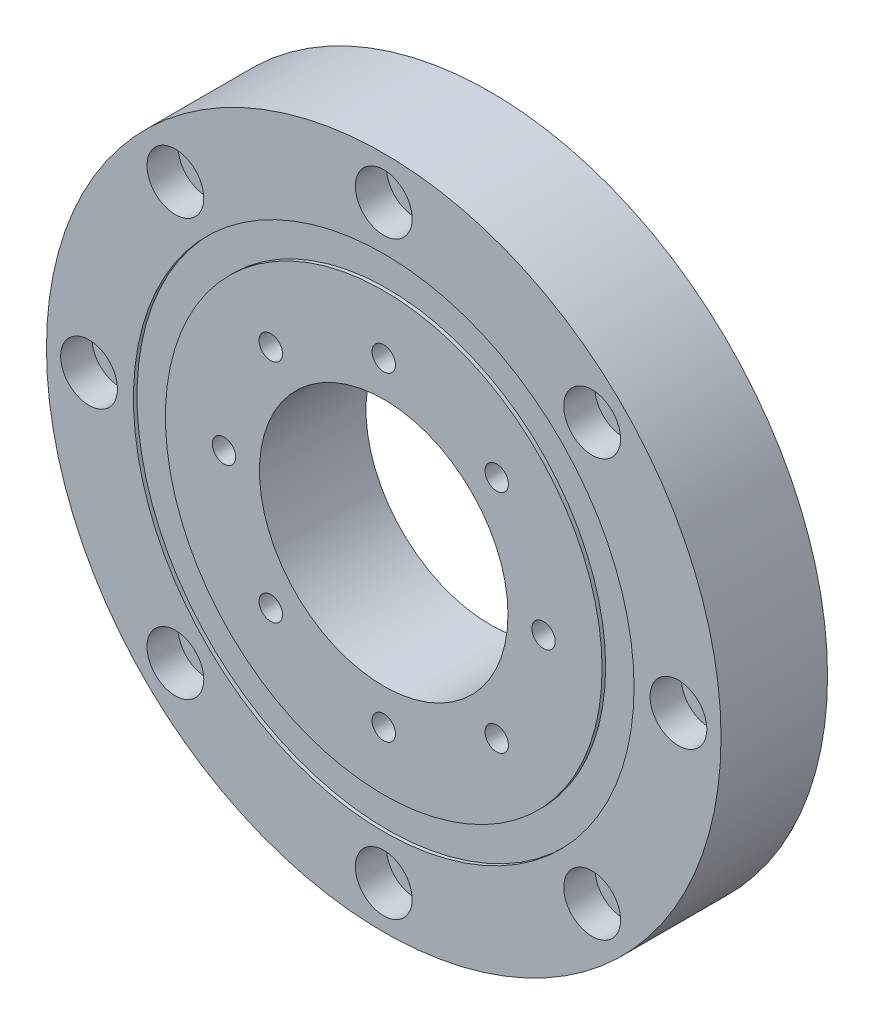
ISO-10303-21;
HEADER;
FILE_DESCRIPTION(('STEP AP214'),'2;1');
FILE_NAME('part.step','',(''),(''),'','','');
FILE_SCHEMA(('AUTOMOTIVE_DESIGN { 1 0 10303 214 1 1 1 1 }'));
ENDSEC;
DATA;
#1=APPLICATION_CONTEXT('core data for automotive mechanical design processes');
#2=APPLICATION_PROTOCOL_DEFINITION('international standard','automotive_design',2000,#1);
#3=PRODUCT_CONTEXT('',#1,'mechanical');
#4=PRODUCT('Part','Part','',(#3));
#5=PRODUCT_RELATED_PRODUCT_CATEGORY('part','',(#4));
#6=PRODUCT_DEFINITION_FORMATION('','',#4);
#7=PRODUCT_DEFINITION_CONTEXT('part definition',#1,'design');
#8=PRODUCT_DEFINITION('design','',#6,#7);
#9=PRODUCT_DEFINITION_SHAPE('','',#8);
#10=(LENGTH_UNIT() NAMED_UNIT(*) SI_UNIT(.MILLI.,.METRE.));
#11=(NAMED_UNIT(*) PLANE_ANGLE_UNIT() SI_UNIT($,.RADIAN.));
#12=(NAMED_UNIT(*) SI_UNIT($,.STERADIAN.) SOLID_ANGLE_UNIT());
#13=UNCERTAINTY_MEASURE_WITH_UNIT(LENGTH_MEASURE(1.E-05),#10,'distance_accuracy_value','');
#14=(GEOMETRIC_REPRESENTATION_CONTEXT(3) GLOBAL_UNCERTAINTY_ASSIGNED_CONTEXT((#13)) GLOBAL_UNIT_ASSIGNED_CONTEXT((#10,
#11,#12)) REPRESENTATION_CONTEXT('',''));
#15=CARTESIAN_POINT('',(0.,0.,0.));
#16=DIRECTION('',(0.,0.,1.));
#17=DIRECTION('',(1.,0.,0.));
#18=AXIS2_PLACEMENT_3D('',#15,#16,#17);
#19=CARTESIAN_POINT('',(0.,0.,-7.5));
#20=DIRECTION('',(0.,0.,1.));
#21=DIRECTION('',(1.,0.,0.));
#22=AXIS2_PLACEMENT_3D('',#19,#20,#21);
#23=PLANE('',#22);
#24=CARTESIAN_POINT('',(15.9099025766971,15.9099025766975,-7.5));
#25=DIRECTION('',(0.,0.,1.));
#26=DIRECTION('',(1.,0.,0.));
#27=AXIS2_PLACEMENT_3D('',#24,#25,#26);
#28=CIRCLE('',#27,1.65);
#29=CARTESIAN_POINT('',(17.5599025766971,15.9099025766975,-7.5));
#30=VERTEX_POINT('',#29);
#31=EDGE_CURVE('E212',#30,#30,#28,.T.);
#32=ORIENTED_EDGE('',*,*,#31,.T.);
#33=EDGE_LOOP('',(#32));
#34=FACE_BOUND('',#33,.T.);
#35=CARTESIAN_POINT('',(22.5,2.35674990371912E-13,-7.5));
#36=DIRECTION('',(0.,0.,1.));
#37=DIRECTION('',(1.,0.,0.));
#38=AXIS2_PLACEMENT_3D('',#35,#36,#37);
#39=CIRCLE('',#38,1.65);
#40=CARTESIAN_POINT('',(24.15,2.35674990371912E-13,-7.5));
#41=VERTEX_POINT('',#40);
#42=EDGE_CURVE('E206',#41,#41,#39,.T.);
#43=ORIENTED_EDGE('',*,*,#42,.T.);
#44=EDGE_LOOP('',(#43));
#45=FACE_BOUND('',#44,.T.);
#46=CARTESIAN_POINT('',(15.9099025766975,-15.9099025766972,-7.5));
#47=DIRECTION('',(0.,0.,1.));
#48=DIRECTION('',(1.,0.,0.));
#49=AXIS2_PLACEMENT_3D('',#46,#47,#48);
#50=CIRCLE('',#49,1.65);
#51=CARTESIAN_POINT('',(17.5599025766975,-15.9099025766972,-7.5));
#52=VERTEX_POINT('',#51);
#53=EDGE_CURVE('E200',#52,#52,#50,.T.);
#54=ORIENTED_EDGE('',*,*,#53,.T.);
#55=EDGE_LOOP('',(#54));
#56=FACE_BOUND('',#55,.T.);
#57=CARTESIAN_POINT('',(0.,-22.5,-7.5));
#58=DIRECTION('',(0.,0.,1.));
#59=DIRECTION('',(1.,0.,0.));
#60=AXIS2_PLACEMENT_3D('',#57,#58,#59);
#61=CIRCLE('',#60,1.65);
#62=CARTESIAN_POINT('',(1.65,-22.5,-7.5));
#63=VERTEX_POINT('',#62);
#64=EDGE_CURVE('E194',#63,#63,#61,.T.);
#65=ORIENTED_EDGE('',*,*,#64,.T.);
#66=EDGE_LOOP('',(#65));
#67=FACE_BOUND('',#66,.T.);
#68=CARTESIAN_POINT('',(-15.9099025766972,-15.9099025766974,-7.5));
#69=DIRECTION('',(0.,0.,1.));
#70=DIRECTION('',(1.,0.,0.));
#71=AXIS2_PLACEMENT_3D('',#68,#69,#70);
#72=CIRCLE('',#71,1.65);
#73=CARTESIAN_POINT('',(-14.2599025766972,-15.9099025766974,-7.5));
#74=VERTEX_POINT('',#73);
#75=EDGE_CURVE('E188',#74,#74,#72,.T.);
#76=ORIENTED_EDGE('',*,*,#75,.T.);
#77=EDGE_LOOP('',(#76));
#78=FACE_BOUND('',#77,.T.);
#79=CARTESIAN_POINT('',(-22.5,0.,-7.5));
#80=DIRECTION('',(0.,0.,1.));
#81=DIRECTION('',(1.,0.,0.));
#82=AXIS2_PLACEMENT_3D('',#79,#80,#81);
#83=CIRCLE('',#82,1.65);
#84=CARTESIAN_POINT('',(-20.85,0.,-7.5));
#85=VERTEX_POINT('',#84);
#86=EDGE_CURVE('E182',#85,#85,#83,.T.);
#87=ORIENTED_EDGE('',*,*,#86,.T.);
#88=EDGE_LOOP('',(#87));
#89=FACE_BOUND('',#88,.T.);
#90=CARTESIAN_POINT('',(-15.9099025766973,15.9099025766973,-7.5));
#91=DIRECTION('',(0.,0.,1.));
#92=DIRECTION('',(1.,0.,0.));
#93=AXIS2_PLACEMENT_3D('',#90,#91,#92);
#94=CIRCLE('',#93,1.65);
#95=CARTESIAN_POINT('',(-14.2599025766973,15.9099025766973,-7.5));
#96=VERTEX_POINT('',#95);
#97=EDGE_CURVE('E176',#96,#96,#94,.T.);
#98=ORIENTED_EDGE('',*,*,#97,.T.);
#99=EDGE_LOOP('',(#98));
#100=FACE_BOUND('',#99,.T.);
#101=CARTESIAN_POINT('',(0.,22.5,-7.5));
#102=DIRECTION('',(0.,0.,1.));
#103=DIRECTION('',(1.,0.,0.));
#104=AXIS2_PLACEMENT_3D('',#101,#102,#103);
#105=CIRCLE('',#104,1.65);
#106=CARTESIAN_POINT('',(1.65,22.5,-7.5));
#107=VERTEX_POINT('',#106);
#108=EDGE_CURVE('E86',#107,#107,#105,.T.);
#109=ORIENTED_EDGE('',*,*,#108,.T.);
#110=EDGE_LOOP('',(#109));
#111=FACE_BOUND('',#110,.T.);
#112=CARTESIAN_POINT('',(0.,0.,-7.5));
#113=DIRECTION('',(0.,0.,1.));
#114=DIRECTION('',(1.,0.,0.));
#115=AXIS2_PLACEMENT_3D('',#112,#113,#114);
#116=CIRCLE('',#115,17.5);
#117=CARTESIAN_POINT('',(17.5,0.,-7.5));
#118=VERTEX_POINT('',#117);
#119=EDGE_CURVE('E43',#118,#118,#116,.T.);
#120=ORIENTED_EDGE('',*,*,#119,.T.);
#121=EDGE_LOOP('',(#120));
#122=FACE_BOUND('',#121,.T.);
#123=CARTESIAN_POINT('',(0.,0.,-7.5));
#124=DIRECTION('',(0.,0.,1.));
#125=DIRECTION('',(1.,0.,0.));
#126=AXIS2_PLACEMENT_3D('',#123,#124,#125);
#127=CIRCLE('',#126,30.75);
#128=CARTESIAN_POINT('',(30.75,0.,-7.5));
#129=VERTEX_POINT('',#128);
#130=EDGE_CURVE('E69',#129,#129,#127,.T.);
#131=ORIENTED_EDGE('',*,*,#130,.F.);
#132=EDGE_LOOP('',(#131));
#133=FACE_BOUND('',#132,.T.);
#134=ADVANCED_FACE('F32',(#34,#45,#56,#67,#78,#89,#100,#111,#122,#133),#23,.F.);
#135=CARTESIAN_POINT('',(0.,0.,7.5));
#136=DIRECTION('',(0.,0.,1.));
#137=DIRECTION('',(1.,0.,0.));
#138=AXIS2_PLACEMENT_3D('',#135,#136,#137);
#139=PLANE('',#138);
#140=CARTESIAN_POINT('',(15.9099025766971,15.9099025766975,7.5));
#141=DIRECTION('',(0.,0.,1.));
#142=DIRECTION('',(1.,0.,0.));
#143=AXIS2_PLACEMENT_3D('',#140,#141,#142);
#144=CIRCLE('',#143,1.65);
#145=CARTESIAN_POINT('',(17.5599025766971,15.9099025766975,7.5));
#146=VERTEX_POINT('',#145);
#147=EDGE_CURVE('E215',#146,#146,#144,.T.);
#148=ORIENTED_EDGE('',*,*,#147,.F.);
#149=EDGE_LOOP('',(#148));
#150=FACE_BOUND('',#149,.T.);
#151=CARTESIAN_POINT('',(22.5,2.35674990371912E-13,7.5));
#152=DIRECTION('',(0.,0.,1.));
#153=DIRECTION('',(1.,0.,0.));
#154=AXIS2_PLACEMENT_3D('',#151,#152,#153);
#155=CIRCLE('',#154,1.65);
#156=CARTESIAN_POINT('',(24.15,2.35674990371912E-13,7.5));
#157=VERTEX_POINT('',#156);
#158=EDGE_CURVE('E209',#157,#157,#155,.T.);
#159=ORIENTED_EDGE('',*,*,#158,.F.);
#160=EDGE_LOOP('',(#159));
#161=FACE_BOUND('',#160,.T.);
#162=CARTESIAN_POINT('',(15.9099025766975,-15.9099025766972,7.5));
#163=DIRECTION('',(0.,0.,1.));
#164=DIRECTION('',(1.,0.,0.));
#165=AXIS2_PLACEMENT_3D('',#162,#163,#164);
#166=CIRCLE('',#165,1.65);
#167=CARTESIAN_POINT('',(17.5599025766975,-15.9099025766972,7.5));
#168=VERTEX_POINT('',#167);
#169=EDGE_CURVE('E203',#168,#168,#166,.T.);
#170=ORIENTED_EDGE('',*,*,#169,.F.);
#171=EDGE_LOOP('',(#170));
#172=FACE_BOUND('',#171,.T.);
#173=CARTESIAN_POINT('',(0.,-22.5,7.5));
#174=DIRECTION('',(0.,0.,1.));
#175=DIRECTION('',(1.,0.,0.));
#176=AXIS2_PLACEMENT_3D('',#173,#174,#175);
#177=CIRCLE('',#176,1.65);
#178=CARTESIAN_POINT('',(1.65,-22.5,7.5));
#179=VERTEX_POINT('',#178);
#180=EDGE_CURVE('E197',#179,#179,#177,.T.);
#181=ORIENTED_EDGE('',*,*,#180,.F.);
#182=EDGE_LOOP('',(#181));
#183=FACE_BOUND('',#182,.T.);
#184=CARTESIAN_POINT('',(-15.9099025766972,-15.9099025766974,7.5));
#185=DIRECTION('',(0.,0.,1.));
#186=DIRECTION('',(1.,0.,0.));
#187=AXIS2_PLACEMENT_3D('',#184,#185,#186);
#188=CIRCLE('',#187,1.65);
#189=CARTESIAN_POINT('',(-14.2599025766972,-15.9099025766974,7.5));
#190=VERTEX_POINT('',#189);
#191=EDGE_CURVE('E191',#190,#190,#188,.T.);
#192=ORIENTED_EDGE('',*,*,#191,.F.);
#193=EDGE_LOOP('',(#192));
#194=FACE_BOUND('',#193,.T.);
#195=CARTESIAN_POINT('',(-22.5,0.,7.5));
#196=DIRECTION('',(0.,0.,1.));
#197=DIRECTION('',(1.,0.,0.));
#198=AXIS2_PLACEMENT_3D('',#195,#196,#197);
#199=CIRCLE('',#198,1.65);
#200=CARTESIAN_POINT('',(-20.85,0.,7.5));
#201=VERTEX_POINT('',#200);
#202=EDGE_CURVE('E185',#201,#201,#199,.T.);
#203=ORIENTED_EDGE('',*,*,#202,.F.);
#204=EDGE_LOOP('',(#203));
#205=FACE_BOUND('',#204,.T.);
#206=CARTESIAN_POINT('',(-15.9099025766973,15.9099025766973,7.5));
#207=DIRECTION('',(0.,0.,1.));
#208=DIRECTION('',(1.,0.,0.));
#209=AXIS2_PLACEMENT_3D('',#206,#207,#208);
#210=CIRCLE('',#209,1.65);
#211=CARTESIAN_POINT('',(-14.2599025766973,15.9099025766973,7.5));
#212=VERTEX_POINT('',#211);
#213=EDGE_CURVE('E179',#212,#212,#210,.T.);
#214=ORIENTED_EDGE('',*,*,#213,.F.);
#215=EDGE_LOOP('',(#214));
#216=FACE_BOUND('',#215,.T.);
#217=CARTESIAN_POINT('',(0.,22.5,7.5));
#218=DIRECTION('',(0.,0.,1.));
#219=DIRECTION('',(1.,0.,0.));
#220=AXIS2_PLACEMENT_3D('',#217,#218,#219);
#221=CIRCLE('',#220,1.65);
#222=CARTESIAN_POINT('',(1.65,22.5,7.5));
#223=VERTEX_POINT('',#222);
#224=EDGE_CURVE('E89',#223,#223,#221,.T.);
#225=ORIENTED_EDGE('',*,*,#224,.F.);
#226=EDGE_LOOP('',(#225));
#227=FACE_BOUND('',#226,.T.);
#228=CARTESIAN_POINT('',(0.,0.,7.5));
#229=DIRECTION('',(0.,0.,1.));
#230=DIRECTION('',(1.,0.,0.));
#231=AXIS2_PLACEMENT_3D('',#228,#229,#230);
#232=CIRCLE('',#231,17.5);
#233=CARTESIAN_POINT('',(17.5,0.,7.5));
#234=VERTEX_POINT('',#233);
#235=EDGE_CURVE('E45',#234,#234,#232,.T.);
#236=ORIENTED_EDGE('',*,*,#235,.F.);
#237=EDGE_LOOP('',(#236));
#238=FACE_BOUND('',#237,.T.);
#239=CARTESIAN_POINT('',(0.,0.,7.5));
#240=DIRECTION('',(0.,0.,1.));
#241=DIRECTION('',(1.,0.,0.));
#242=AXIS2_PLACEMENT_3D('',#239,#240,#241);
#243=CIRCLE('',#242,30.75);
#244=CARTESIAN_POINT('',(30.75,0.,7.5));
#245=VERTEX_POINT('',#244);
#246=EDGE_CURVE('E57',#245,#245,#243,.T.);
#247=ORIENTED_EDGE('',*,*,#246,.T.);
#248=EDGE_LOOP('',(#247));
#249=FACE_BOUND('',#248,.T.);
#250=ADVANCED_FACE('F221',(#150,#161,#172,#183,#194,#205,#216,#227,#238,#249),#139,.T.);
#251=CARTESIAN_POINT('',(0.,0.,7.5));
#252=DIRECTION('',(0.,0.,-1.));
#253=DIRECTION('',(-1.,0.,0.));
#254=AXIS2_PLACEMENT_3D('',#251,#252,#253);
#255=CYLINDRICAL_SURFACE('',#254,47.5);
#256=CARTESIAN_POINT('',(0.,0.,7.5));
#257=DIRECTION('',(0.,0.,1.));
#258=DIRECTION('',(1.,0.,0.));
#259=AXIS2_PLACEMENT_3D('',#256,#257,#258);
#260=CIRCLE('',#259,47.5);
#261=CARTESIAN_POINT('',(47.5,0.,7.5));
#262=VERTEX_POINT('',#261);
#263=EDGE_CURVE('E10',#262,#262,#260,.T.);
#264=ORIENTED_EDGE('',*,*,#263,.F.);
#265=EDGE_LOOP('',(#264));
#266=FACE_BOUND('',#265,.T.);
#267=CARTESIAN_POINT('',(0.,0.,-7.5));
#268=DIRECTION('',(0.,0.,1.));
#269=DIRECTION('',(1.,0.,0.));
#270=AXIS2_PLACEMENT_3D('',#267,#268,#269);
#271=CIRCLE('',#270,47.5);
#272=CARTESIAN_POINT('',(47.5,0.,-7.5));
#273=VERTEX_POINT('',#272);
#274=EDGE_CURVE('E36',#273,#273,#271,.T.);
#275=ORIENTED_EDGE('',*,*,#274,.T.);
#276=EDGE_LOOP('',(#275));
#277=FACE_BOUND('',#276,.T.);
#278=ADVANCED_FACE('F34',(#266,#277),#255,.T.);
#279=CARTESIAN_POINT('',(29.3449314192414,29.3449314192421,7.5));
#280=DIRECTION('',(0.,0.,1.));
#281=DIRECTION('',(1.,0.,0.));
#282=AXIS2_PLACEMENT_3D('',#279,#280,#281);
#283=CIRCLE('',#282,4.);
#284=CARTESIAN_POINT('',(33.3449314192414,29.3449314192421,7.5));
#285=VERTEX_POINT('',#284);
#286=EDGE_CURVE('E173',#285,#285,#283,.T.);
#287=ORIENTED_EDGE('',*,*,#286,.F.);
#288=EDGE_LOOP('',(#287));
#289=FACE_BOUND('',#288,.T.);
#290=CARTESIAN_POINT('',(41.5,4.23177746773985E-13,7.5));
#291=DIRECTION('',(0.,0.,1.));
#292=DIRECTION('',(1.,0.,0.));
#293=AXIS2_PLACEMENT_3D('',#290,#291,#292);
#294=CIRCLE('',#293,4.);
#295=CARTESIAN_POINT('',(45.5,4.23177746773985E-13,7.5));
#296=VERTEX_POINT('',#295);
#297=EDGE_CURVE('E161',#296,#296,#294,.T.);
#298=ORIENTED_EDGE('',*,*,#297,.F.);
#299=EDGE_LOOP('',(#298));
#300=FACE_BOUND('',#299,.T.);
#301=CARTESIAN_POINT('',(29.344931419242,-29.3449314192415,7.5));
#302=DIRECTION('',(0.,0.,1.));
#303=DIRECTION('',(1.,0.,0.));
#304=AXIS2_PLACEMENT_3D('',#301,#302,#303);
#305=CIRCLE('',#304,4.);
#306=CARTESIAN_POINT('',(33.344931419242,-29.3449314192415,7.5));
#307=VERTEX_POINT('',#306);
#308=EDGE_CURVE('E149',#307,#307,#305,.T.);
#309=ORIENTED_EDGE('',*,*,#308,.F.);
#310=EDGE_LOOP('',(#309));
#311=FACE_BOUND('',#310,.T.);
#312=CARTESIAN_POINT('',(0.,-41.5,7.5));
#313=DIRECTION('',(0.,0.,1.));
#314=DIRECTION('',(1.,0.,0.));
#315=AXIS2_PLACEMENT_3D('',#312,#313,#314);
#316=CIRCLE('',#315,4.);
#317=CARTESIAN_POINT('',(3.99999999999999,-41.5,7.5));
#318=VERTEX_POINT('',#317);
#319=EDGE_CURVE('E137',#318,#318,#316,.T.);
#320=ORIENTED_EDGE('',*,*,#319,.F.);
#321=EDGE_LOOP('',(#320));
#322=FACE_BOUND('',#321,.T.);
#323=CARTESIAN_POINT('',(-29.3449314192416,-29.3449314192419,7.5));
#324=DIRECTION('',(0.,0.,1.));
#325=DIRECTION('',(1.,0.,0.));
#326=AXIS2_PLACEMENT_3D('',#323,#324,#325);
#327=CIRCLE('',#326,4.);
#328=CARTESIAN_POINT('',(-25.3449314192416,-29.3449314192419,7.5));
#329=VERTEX_POINT('',#328);
#330=EDGE_CURVE('E125',#329,#329,#327,.T.);
#331=ORIENTED_EDGE('',*,*,#330,.F.);
#332=EDGE_LOOP('',(#331));
#333=FACE_BOUND('',#332,.T.);
#334=CARTESIAN_POINT('',(-41.5,-1.33384795650005E-13,7.5));
#335=DIRECTION('',(0.,0.,1.));
#336=DIRECTION('',(1.,0.,0.));
#337=AXIS2_PLACEMENT_3D('',#334,#335,#336);
#338=CIRCLE('',#337,4.);
#339=CARTESIAN_POINT('',(-37.5,-1.33384795650005E-13,7.5));
#340=VERTEX_POINT('',#339);
#341=EDGE_CURVE('E113',#340,#340,#338,.T.);
#342=ORIENTED_EDGE('',*,*,#341,.F.);
#343=EDGE_LOOP('',(#342));
#344=FACE_BOUND('',#343,.T.);
#345=CARTESIAN_POINT('',(-29.3449314192418,29.3449314192417,7.5));
#346=DIRECTION('',(0.,0.,1.));
#347=DIRECTION('',(1.,0.,0.));
#348=AXIS2_PLACEMENT_3D('',#345,#346,#347);
#349=CIRCLE('',#348,4.);
#350=CARTESIAN_POINT('',(-25.3449314192418,29.3449314192417,7.5));
#351=VERTEX_POINT('',#350);
#352=EDGE_CURVE('E101',#351,#351,#349,.T.);
#353=ORIENTED_EDGE('',*,*,#352,.F.);
#354=EDGE_LOOP('',(#353));
#355=FACE_BOUND('',#354,.T.);
#356=CARTESIAN_POINT('',(0.,41.5,7.5));
#357=DIRECTION('',(0.,0.,1.));
#358=DIRECTION('',(1.,0.,0.));
#359=AXIS2_PLACEMENT_3D('',#356,#357,#358);
#360=CIRCLE('',#359,4.);
#361=CARTESIAN_POINT('',(4.00000000000001,41.5,7.5));
#362=VERTEX_POINT('',#361);
#363=EDGE_CURVE('E83',#362,#362,#360,.T.);
#364=ORIENTED_EDGE('',*,*,#363,.F.);
#365=EDGE_LOOP('',(#364));
#366=FACE_BOUND('',#365,.T.);
#367=CARTESIAN_POINT('',(0.,0.,7.5));
#368=DIRECTION('',(0.,0.,1.));
#369=DIRECTION('',(1.,0.,0.));
#370=AXIS2_PLACEMENT_3D('',#367,#368,#369);
#371=CIRCLE('',#370,35.25);
#372=CARTESIAN_POINT('',(35.25,0.,7.5));
#373=VERTEX_POINT('',#372);
#374=EDGE_CURVE('E51',#373,#373,#371,.T.);
#375=ORIENTED_EDGE('',*,*,#374,.F.);
#376=EDGE_LOOP('',(#375));
#377=FACE_BOUND('',#376,.T.);
#378=ORIENTED_EDGE('',*,*,#263,.T.);
#379=EDGE_LOOP('',(#378));
#380=FACE_BOUND('',#379,.T.);
#381=ADVANCED_FACE('F225',(#289,#300,#311,#322,#333,#344,#355,#366,#377,#380),#139,.T.);
#382=CARTESIAN_POINT('',(29.3449314192414,29.3449314192421,-7.5));
#383=DIRECTION('',(0.,0.,1.));
#384=DIRECTION('',(1.,0.,0.));
#385=AXIS2_PLACEMENT_3D('',#382,#383,#384);
#386=CIRCLE('',#385,2.25);
#387=CARTESIAN_POINT('',(31.5949314192414,29.3449314192421,-7.5));
#388=VERTEX_POINT('',#387);
#389=EDGE_CURVE('E164',#388,#388,#386,.T.);
#390=ORIENTED_EDGE('',*,*,#389,.T.);
#391=EDGE_LOOP('',(#390));
#392=FACE_BOUND('',#391,.T.);
#393=CARTESIAN_POINT('',(41.5,4.23177746773985E-13,-7.5));
#394=DIRECTION('',(0.,0.,1.));
#395=DIRECTION('',(1.,0.,0.));
#396=AXIS2_PLACEMENT_3D('',#393,#394,#395);
#397=CIRCLE('',#396,2.25);
#398=CARTESIAN_POINT('',(43.75,4.23177746773985E-13,-7.5));
#399=VERTEX_POINT('',#398);
#400=EDGE_CURVE('E152',#399,#399,#397,.T.);
#401=ORIENTED_EDGE('',*,*,#400,.T.);
#402=EDGE_LOOP('',(#401));
#403=FACE_BOUND('',#402,.T.);
#404=CARTESIAN_POINT('',(29.344931419242,-29.3449314192415,-7.5));
#405=DIRECTION('',(0.,0.,1.));
#406=DIRECTION('',(1.,0.,0.));
#407=AXIS2_PLACEMENT_3D('',#404,#405,#406);
#408=CIRCLE('',#407,2.25);
#409=CARTESIAN_POINT('',(31.594931419242,-29.3449314192415,-7.5));
#410=VERTEX_POINT('',#409);
#411=EDGE_CURVE('E140',#410,#410,#408,.T.);
#412=ORIENTED_EDGE('',*,*,#411,.T.);
#413=EDGE_LOOP('',(#412));
#414=FACE_BOUND('',#413,.T.);
#415=CARTESIAN_POINT('',(0.,-41.5,-7.5));
#416=DIRECTION('',(0.,0.,1.));
#417=DIRECTION('',(1.,0.,0.));
#418=AXIS2_PLACEMENT_3D('',#415,#416,#417);
#419=CIRCLE('',#418,2.25);
#420=CARTESIAN_POINT('',(2.24999999999998,-41.5,-7.5));
#421=VERTEX_POINT('',#420);
#422=EDGE_CURVE('E128',#421,#421,#419,.T.);
#423=ORIENTED_EDGE('',*,*,#422,.T.);
#424=EDGE_LOOP('',(#423));
#425=FACE_BOUND('',#424,.T.);
#426=CARTESIAN_POINT('',(-29.3449314192416,-29.3449314192419,-7.5));
#427=DIRECTION('',(0.,0.,1.));
#428=DIRECTION('',(1.,0.,0.));
#429=AXIS2_PLACEMENT_3D('',#426,#427,#428);
#430=CIRCLE('',#429,2.25);
#431=CARTESIAN_POINT('',(-27.0949314192416,-29.3449314192419,-7.5));
#432=VERTEX_POINT('',#431);
#433=EDGE_CURVE('E116',#432,#432,#430,.T.);
#434=ORIENTED_EDGE('',*,*,#433,.T.);
#435=EDGE_LOOP('',(#434));
#436=FACE_BOUND('',#435,.T.);
#437=CARTESIAN_POINT('',(-41.5,-1.33384795650005E-13,-7.5));
#438=DIRECTION('',(0.,0.,1.));
#439=DIRECTION('',(1.,0.,0.));
#440=AXIS2_PLACEMENT_3D('',#437,#438,#439);
#441=CIRCLE('',#440,2.25);
#442=CARTESIAN_POINT('',(-39.25,-1.33384795650005E-13,-7.5));
#443=VERTEX_POINT('',#442);
#444=EDGE_CURVE('E104',#443,#443,#441,.T.);
#445=ORIENTED_EDGE('',*,*,#444,.T.);
#446=EDGE_LOOP('',(#445));
#447=FACE_BOUND('',#446,.T.);
#448=CARTESIAN_POINT('',(-29.3449314192418,29.3449314192417,-7.5));
#449=DIRECTION('',(0.,0.,1.));
#450=DIRECTION('',(1.,0.,0.));
#451=AXIS2_PLACEMENT_3D('',#448,#449,#450);
#452=CIRCLE('',#451,2.25);
#453=CARTESIAN_POINT('',(-27.0949314192418,29.3449314192417,-7.5));
#454=VERTEX_POINT('',#453);
#455=EDGE_CURVE('E92',#454,#454,#452,.T.);
#456=ORIENTED_EDGE('',*,*,#455,.T.);
#457=EDGE_LOOP('',(#456));
#458=FACE_BOUND('',#457,.T.);
#459=CARTESIAN_POINT('',(0.,41.5,-7.5));
#460=DIRECTION('',(0.,0.,1.));
#461=DIRECTION('',(1.,0.,0.));
#462=AXIS2_PLACEMENT_3D('',#459,#460,#461);
#463=CIRCLE('',#462,2.25);
#464=CARTESIAN_POINT('',(2.25000000000001,41.5,-7.5));
#465=VERTEX_POINT('',#464);
#466=EDGE_CURVE('E72',#465,#465,#463,.T.);
#467=ORIENTED_EDGE('',*,*,#466,.T.);
#468=EDGE_LOOP('',(#467));
#469=FACE_BOUND('',#468,.T.);
#470=CARTESIAN_POINT('',(0.,0.,-7.5));
#471=DIRECTION('',(0.,0.,1.));
#472=DIRECTION('',(1.,0.,0.));
#473=AXIS2_PLACEMENT_3D('',#470,#471,#472);
#474=CIRCLE('',#473,35.25);
#475=CARTESIAN_POINT('',(35.25,0.,-7.5));
#476=VERTEX_POINT('',#475);
#477=EDGE_CURVE('E63',#476,#476,#474,.T.);
#478=ORIENTED_EDGE('',*,*,#477,.T.);
#479=EDGE_LOOP('',(#478));
#480=FACE_BOUND('',#479,.T.);
#481=ORIENTED_EDGE('',*,*,#274,.F.);
#482=EDGE_LOOP('',(#481));
#483=FACE_BOUND('',#482,.T.);
#484=ADVANCED_FACE('F263',(#392,#403,#414,#425,#436,#447,#458,#469,#480,#483),#23,.F.);
#485=CARTESIAN_POINT('',(0.,0.,-7.5));
#486=DIRECTION('',(0.,0.,1.));
#487=DIRECTION('',(1.,0.,0.));
#488=AXIS2_PLACEMENT_3D('',#485,#486,#487);
#489=CYLINDRICAL_SURFACE('',#488,17.5);
#490=ORIENTED_EDGE('',*,*,#119,.F.);
#491=EDGE_LOOP('',(#490));
#492=FACE_BOUND('',#491,.T.);
#493=ORIENTED_EDGE('',*,*,#235,.T.);
#494=EDGE_LOOP('',(#493));
#495=FACE_BOUND('',#494,.T.);
#496=ADVANCED_FACE('F268',(#492,#495),#489,.F.);
#497=CARTESIAN_POINT('',(0.,0.,7.));
#498=DIRECTION('',(0.,0.,1.));
#499=DIRECTION('',(1.,0.,0.));
#500=AXIS2_PLACEMENT_3D('',#497,#498,#499);
#501=CYLINDRICAL_SURFACE('',#500,35.25);
#502=CARTESIAN_POINT('',(0.,0.,7.));
#503=DIRECTION('',(0.,0.,1.));
#504=DIRECTION('',(1.,0.,0.));
#505=AXIS2_PLACEMENT_3D('',#502,#503,#504);
#506=CIRCLE('',#505,35.25);
#507=CARTESIAN_POINT('',(35.25,0.,7.));
#508=VERTEX_POINT('',#507);
#509=EDGE_CURVE('E48',#508,#508,#506,.T.);
#510=ORIENTED_EDGE('',*,*,#509,.F.);
#511=EDGE_LOOP('',(#510));
#512=FACE_BOUND('',#511,.T.);
#513=ORIENTED_EDGE('',*,*,#374,.T.);
#514=EDGE_LOOP('',(#513));
#515=FACE_BOUND('',#514,.T.);
#516=ADVANCED_FACE('F257',(#512,#515),#501,.F.);
#517=CARTESIAN_POINT('',(0.,0.,7.));
#518=DIRECTION('',(0.,0.,1.));
#519=DIRECTION('',(1.,0.,0.));
#520=AXIS2_PLACEMENT_3D('',#517,#518,#519);
#521=PLANE('',#520);
#522=CARTESIAN_POINT('',(0.,0.,7.));
#523=DIRECTION('',(0.,0.,1.));
#524=DIRECTION('',(1.,0.,0.));
#525=AXIS2_PLACEMENT_3D('',#522,#523,#524);
#526=CIRCLE('',#525,30.75);
#527=CARTESIAN_POINT('',(30.75,0.,7.));
#528=VERTEX_POINT('',#527);
#529=EDGE_CURVE('E54',#528,#528,#526,.T.);
#530=ORIENTED_EDGE('',*,*,#529,.F.);
#531=EDGE_LOOP('',(#530));
#532=FACE_BOUND('',#531,.T.);
#533=ORIENTED_EDGE('',*,*,#509,.T.);
#534=EDGE_LOOP('',(#533));
#535=FACE_BOUND('',#534,.T.);
#536=ADVANCED_FACE('F247',(#532,#535),#521,.T.);
#537=CARTESIAN_POINT('',(0.,0.,7.));
#538=DIRECTION('',(0.,0.,1.));
#539=DIRECTION('',(1.,0.,0.));
#540=AXIS2_PLACEMENT_3D('',#537,#538,#539);
#541=CYLINDRICAL_SURFACE('',#540,30.75);
#542=ORIENTED_EDGE('',*,*,#529,.T.);
#543=EDGE_LOOP('',(#542));
#544=FACE_BOUND('',#543,.T.);
#545=ORIENTED_EDGE('',*,*,#246,.F.);
#546=EDGE_LOOP('',(#545));
#547=FACE_BOUND('',#546,.T.);
#548=ADVANCED_FACE('F244',(#544,#547),#541,.T.);
#549=CARTESIAN_POINT('',(0.,0.,-7.));
#550=DIRECTION('',(0.,0.,-1.));
#551=DIRECTION('',(1.,0.,0.));
#552=AXIS2_PLACEMENT_3D('',#549,#550,#551);
#553=PLANE('',#552);
#554=CARTESIAN_POINT('',(0.,0.,-7.));
#555=DIRECTION('',(0.,0.,1.));
#556=DIRECTION('',(1.,0.,0.));
#557=AXIS2_PLACEMENT_3D('',#554,#555,#556);
#558=CIRCLE('',#557,35.25);
#559=CARTESIAN_POINT('',(35.25,0.,-7.));
#560=VERTEX_POINT('',#559);
#561=EDGE_CURVE('E60',#560,#560,#558,.T.);
#562=ORIENTED_EDGE('',*,*,#561,.F.);
#563=EDGE_LOOP('',(#562));
#564=FACE_BOUND('',#563,.T.);
#565=CARTESIAN_POINT('',(0.,0.,-7.));
#566=DIRECTION('',(0.,0.,1.));
#567=DIRECTION('',(1.,0.,0.));
#568=AXIS2_PLACEMENT_3D('',#565,#566,#567);
#569=CIRCLE('',#568,30.75);
#570=CARTESIAN_POINT('',(30.75,0.,-7.));
#571=VERTEX_POINT('',#570);
#572=EDGE_CURVE('E66',#571,#571,#569,.T.);
#573=ORIENTED_EDGE('',*,*,#572,.T.);
#574=EDGE_LOOP('',(#573));
#575=FACE_BOUND('',#574,.T.);
#576=ADVANCED_FACE('F246',(#564,#575),#553,.T.);
#577=CARTESIAN_POINT('',(0.,0.,-7.));
#578=DIRECTION('',(0.,0.,-1.));
#579=DIRECTION('',(-1.,0.,0.));
#580=AXIS2_PLACEMENT_3D('',#577,#578,#579);
#581=CYLINDRICAL_SURFACE('',#580,35.25);
#582=ORIENTED_EDGE('',*,*,#561,.T.);
#583=EDGE_LOOP('',(#582));
#584=FACE_BOUND('',#583,.T.);
#585=ORIENTED_EDGE('',*,*,#477,.F.);
#586=EDGE_LOOP('',(#585));
#587=FACE_BOUND('',#586,.T.);
#588=ADVANCED_FACE('F254',(#584,#587),#581,.F.);
#589=CARTESIAN_POINT('',(0.,0.,-7.));
#590=DIRECTION('',(0.,0.,-1.));
#591=DIRECTION('',(-1.,0.,0.));
#592=AXIS2_PLACEMENT_3D('',#589,#590,#591);
#593=CYLINDRICAL_SURFACE('',#592,30.75);
#594=ORIENTED_EDGE('',*,*,#572,.F.);
#595=EDGE_LOOP('',(#594));
#596=FACE_BOUND('',#595,.T.);
#597=ORIENTED_EDGE('',*,*,#130,.T.);
#598=EDGE_LOOP('',(#597));
#599=FACE_BOUND('',#598,.T.);
#600=ADVANCED_FACE('F616',(#596,#599),#593,.T.);
#601=CARTESIAN_POINT('',(0.,41.5,7.5));
#602=DIRECTION('',(0.,0.,1.));
#603=DIRECTION('',(1.,0.,0.));
#604=AXIS2_PLACEMENT_3D('',#601,#602,#603);
#605=CYLINDRICAL_SURFACE('',#604,2.25);
#606=ORIENTED_EDGE('',*,*,#466,.F.);
#607=EDGE_LOOP('',(#606));
#608=FACE_BOUND('',#607,.T.);
#609=CARTESIAN_POINT('',(0.,41.5,3.1));
#610=DIRECTION('',(0.,0.,1.));
#611=DIRECTION('',(1.,0.,0.));
#612=AXIS2_PLACEMENT_3D('',#609,#610,#611);
#613=CIRCLE('',#612,2.25);
#614=CARTESIAN_POINT('',(2.25000000000001,41.5,3.1));
#615=VERTEX_POINT('',#614);
#616=EDGE_CURVE('E77',#615,#615,#613,.T.);
#617=ORIENTED_EDGE('',*,*,#616,.T.);
#618=EDGE_LOOP('',(#617));
#619=FACE_BOUND('',#618,.T.);
#620=ADVANCED_FACE('F612',(#608,#619),#605,.F.);
#621=CARTESIAN_POINT('',(2.25000000000001,41.5,3.1));
#622=DIRECTION('',(0.,0.,-1.));
#623=DIRECTION('',(-1.,0.,0.));
#624=AXIS2_PLACEMENT_3D('',#621,#622,#623);
#625=PLANE('',#624);
#626=ORIENTED_EDGE('',*,*,#616,.F.);
#627=EDGE_LOOP('',(#626));
#628=FACE_BOUND('',#627,.T.);
#629=CARTESIAN_POINT('',(0.,41.5,3.1));
#630=DIRECTION('',(0.,0.,1.));
#631=DIRECTION('',(1.,0.,0.));
#632=AXIS2_PLACEMENT_3D('',#629,#630,#631);
#633=CIRCLE('',#632,4.);
#634=CARTESIAN_POINT('',(4.00000000000001,41.5,3.1));
#635=VERTEX_POINT('',#634);
#636=EDGE_CURVE('E80',#635,#635,#633,.T.);
#637=ORIENTED_EDGE('',*,*,#636,.T.);
#638=EDGE_LOOP('',(#637));
#639=FACE_BOUND('',#638,.T.);
#640=ADVANCED_FACE('F608',(#628,#639),#625,.F.);
#641=CARTESIAN_POINT('',(0.,41.5,7.5));
#642=DIRECTION('',(0.,0.,1.));
#643=DIRECTION('',(1.,0.,0.));
#644=AXIS2_PLACEMENT_3D('',#641,#642,#643);
#645=CYLINDRICAL_SURFACE('',#644,4.);
#646=ORIENTED_EDGE('',*,*,#636,.F.);
#647=EDGE_LOOP('',(#646));
#648=FACE_BOUND('',#647,.T.);
#649=ORIENTED_EDGE('',*,*,#363,.T.);
#650=EDGE_LOOP('',(#649));
#651=FACE_BOUND('',#650,.T.);
#652=ADVANCED_FACE('F604',(#648,#651),#645,.F.);
#653=CARTESIAN_POINT('',(0.,22.5,7.5));
#654=DIRECTION('',(0.,0.,1.));
#655=DIRECTION('',(1.,0.,0.));
#656=AXIS2_PLACEMENT_3D('',#653,#654,#655);
#657=CYLINDRICAL_SURFACE('',#656,1.65);
#658=ORIENTED_EDGE('',*,*,#108,.F.);
#659=EDGE_LOOP('',(#658));
#660=FACE_BOUND('',#659,.T.);
#661=ORIENTED_EDGE('',*,*,#224,.T.);
#662=EDGE_LOOP('',(#661));
#663=FACE_BOUND('',#662,.T.);
#664=ADVANCED_FACE('F326',(#660,#663),#657,.F.);
#665=CARTESIAN_POINT('',(-29.3449314192418,29.3449314192417,7.5));
#666=DIRECTION('',(0.,0.,1.));
#667=DIRECTION('',(1.,0.,0.));
#668=AXIS2_PLACEMENT_3D('',#665,#666,#667);
#669=CYLINDRICAL_SURFACE('',#668,2.25);
#670=ORIENTED_EDGE('',*,*,#455,.F.);
#671=EDGE_LOOP('',(#670));
#672=FACE_BOUND('',#671,.T.);
#673=CARTESIAN_POINT('',(-29.3449314192418,29.3449314192417,3.1));
#674=DIRECTION('',(0.,0.,1.));
#675=DIRECTION('',(1.,0.,0.));
#676=AXIS2_PLACEMENT_3D('',#673,#674,#675);
#677=CIRCLE('',#676,2.25);
#678=CARTESIAN_POINT('',(-27.0949314192418,29.3449314192417,3.1));
#679=VERTEX_POINT('',#678);
#680=EDGE_CURVE('E95',#679,#679,#677,.T.);
#681=ORIENTED_EDGE('',*,*,#680,.T.);
#682=EDGE_LOOP('',(#681));
#683=FACE_BOUND('',#682,.T.);
#684=ADVANCED_FACE('F320',(#672,#683),#669,.F.);
#685=CARTESIAN_POINT('',(-27.0949314192418,29.3449314192417,3.1));
#686=DIRECTION('',(0.,0.,-1.));
#687=DIRECTION('',(-1.,0.,0.));
#688=AXIS2_PLACEMENT_3D('',#685,#686,#687);
#689=PLANE('',#688);
#690=ORIENTED_EDGE('',*,*,#680,.F.);
#691=EDGE_LOOP('',(#690));
#692=FACE_BOUND('',#691,.T.);
#693=CARTESIAN_POINT('',(-29.3449314192418,29.3449314192417,3.1));
#694=DIRECTION('',(0.,0.,1.));
#695=DIRECTION('',(1.,0.,0.));
#696=AXIS2_PLACEMENT_3D('',#693,#694,#695);
#697=CIRCLE('',#696,4.);
#698=CARTESIAN_POINT('',(-25.3449314192418,29.3449314192417,3.1));
#699=VERTEX_POINT('',#698);
#700=EDGE_CURVE('E98',#699,#699,#697,.T.);
#701=ORIENTED_EDGE('',*,*,#700,.T.);
#702=EDGE_LOOP('',(#701));
#703=FACE_BOUND('',#702,.T.);
#704=ADVANCED_FACE('F325',(#692,#703),#689,.F.);
#705=CARTESIAN_POINT('',(-29.3449314192418,29.3449314192417,7.5));
#706=DIRECTION('',(0.,0.,1.));
#707=DIRECTION('',(1.,0.,0.));
#708=AXIS2_PLACEMENT_3D('',#705,#706,#707);
#709=CYLINDRICAL_SURFACE('',#708,4.);
#710=ORIENTED_EDGE('',*,*,#700,.F.);
#711=EDGE_LOOP('',(#710));
#712=FACE_BOUND('',#711,.T.);
#713=ORIENTED_EDGE('',*,*,#352,.T.);
#714=EDGE_LOOP('',(#713));
#715=FACE_BOUND('',#714,.T.);
#716=ADVANCED_FACE('F338',(#712,#715),#709,.F.);
#717=CARTESIAN_POINT('',(-41.5,-1.33384795650005E-13,7.5));
#718=DIRECTION('',(0.,0.,1.));
#719=DIRECTION('',(1.,0.,0.));
#720=AXIS2_PLACEMENT_3D('',#717,#718,#719);
#721=CYLINDRICAL_SURFACE('',#720,2.25);
#722=ORIENTED_EDGE('',*,*,#444,.F.);
#723=EDGE_LOOP('',(#722));
#724=FACE_BOUND('',#723,.T.);
#725=CARTESIAN_POINT('',(-41.5,-1.33384795650005E-13,3.1));
#726=DIRECTION('',(0.,0.,1.));
#727=DIRECTION('',(1.,0.,0.));
#728=AXIS2_PLACEMENT_3D('',#725,#726,#727);
#729=CIRCLE('',#728,2.25);
#730=CARTESIAN_POINT('',(-39.25,-1.33384795650005E-13,3.1));
#731=VERTEX_POINT('',#730);
#732=EDGE_CURVE('E107',#731,#731,#729,.T.);
#733=ORIENTED_EDGE('',*,*,#732,.T.);
#734=EDGE_LOOP('',(#733));
#735=FACE_BOUND('',#734,.T.);
#736=ADVANCED_FACE('F348',(#724,#735),#721,.F.);
#737=CARTESIAN_POINT('',(-39.25,-1.33384795650005E-13,3.1));
#738=DIRECTION('',(0.,0.,-1.));
#739=DIRECTION('',(-1.,0.,0.));
#740=AXIS2_PLACEMENT_3D('',#737,#738,#739);
#741=PLANE('',#740);
#742=ORIENTED_EDGE('',*,*,#732,.F.);
#743=EDGE_LOOP('',(#742));
#744=FACE_BOUND('',#743,.T.);
#745=CARTESIAN_POINT('',(-41.5,-1.33384795650005E-13,3.1));
#746=DIRECTION('',(0.,0.,1.));
#747=DIRECTION('',(1.,0.,0.));
#748=AXIS2_PLACEMENT_3D('',#745,#746,#747);
#749=CIRCLE('',#748,4.);
#750=CARTESIAN_POINT('',(-37.5,-1.33384795650005E-13,3.1));
#751=VERTEX_POINT('',#750);
#752=EDGE_CURVE('E110',#751,#751,#749,.T.);
#753=ORIENTED_EDGE('',*,*,#752,.T.);
#754=EDGE_LOOP('',(#753));
#755=FACE_BOUND('',#754,.T.);
#756=ADVANCED_FACE('F358',(#744,#755),#741,.F.);
#757=CARTESIAN_POINT('',(-41.5,-1.33384795650005E-13,7.5));
#758=DIRECTION('',(0.,0.,1.));
#759=DIRECTION('',(1.,0.,0.));
#760=AXIS2_PLACEMENT_3D('',#757,#758,#759);
#761=CYLINDRICAL_SURFACE('',#760,4.);
#762=ORIENTED_EDGE('',*,*,#752,.F.);
#763=EDGE_LOOP('',(#762));
#764=FACE_BOUND('',#763,.T.);
#765=ORIENTED_EDGE('',*,*,#341,.T.);
#766=EDGE_LOOP('',(#765));
#767=FACE_BOUND('',#766,.T.);
#768=ADVANCED_FACE('F368',(#764,#767),#761,.F.);
#769=CARTESIAN_POINT('',(-29.3449314192416,-29.3449314192419,7.5));
#770=DIRECTION('',(0.,0.,1.));
#771=DIRECTION('',(1.,0.,0.));
#772=AXIS2_PLACEMENT_3D('',#769,#770,#771);
#773=CYLINDRICAL_SURFACE('',#772,2.25);
#774=ORIENTED_EDGE('',*,*,#433,.F.);
#775=EDGE_LOOP('',(#774));
#776=FACE_BOUND('',#775,.T.);
#777=CARTESIAN_POINT('',(-29.3449314192416,-29.3449314192419,3.1));
#778=DIRECTION('',(0.,0.,1.));
#779=DIRECTION('',(1.,0.,0.));
#780=AXIS2_PLACEMENT_3D('',#777,#778,#779);
#781=CIRCLE('',#780,2.25);
#782=CARTESIAN_POINT('',(-27.0949314192416,-29.3449314192419,3.1));
#783=VERTEX_POINT('',#782);
#784=EDGE_CURVE('E119',#783,#783,#781,.T.);
#785=ORIENTED_EDGE('',*,*,#784,.T.);
#786=EDGE_LOOP('',(#785));
#787=FACE_BOUND('',#786,.T.);
#788=ADVANCED_FACE('F378',(#776,#787),#773,.F.);
#789=CARTESIAN_POINT('',(-27.0949314192416,-29.3449314192419,3.1));
#790=DIRECTION('',(0.,0.,-1.));
#791=DIRECTION('',(-1.,0.,0.));
#792=AXIS2_PLACEMENT_3D('',#789,#790,#791);
#793=PLANE('',#792);
#794=ORIENTED_EDGE('',*,*,#784,.F.);
#795=EDGE_LOOP('',(#794));
#796=FACE_BOUND('',#795,.T.);
#797=CARTESIAN_POINT('',(-29.3449314192416,-29.3449314192419,3.1));
#798=DIRECTION('',(0.,0.,1.));
#799=DIRECTION('',(1.,0.,0.));
#800=AXIS2_PLACEMENT_3D('',#797,#798,#799);
#801=CIRCLE('',#800,4.);
#802=CARTESIAN_POINT('',(-25.3449314192416,-29.3449314192419,3.1));
#803=VERTEX_POINT('',#802);
#804=EDGE_CURVE('E122',#803,#803,#801,.T.);
#805=ORIENTED_EDGE('',*,*,#804,.T.);
#806=EDGE_LOOP('',(#805));
#807=FACE_BOUND('',#806,.T.);
#808=ADVANCED_FACE('F388',(#796,#807),#793,.F.);
#809=CARTESIAN_POINT('',(-29.3449314192416,-29.3449314192419,7.5));
#810=DIRECTION('',(0.,0.,1.));
#811=DIRECTION('',(1.,0.,0.));
#812=AXIS2_PLACEMENT_3D('',#809,#810,#811);
#813=CYLINDRICAL_SURFACE('',#812,4.);
#814=ORIENTED_EDGE('',*,*,#804,.F.);
#815=EDGE_LOOP('',(#814));
#816=FACE_BOUND('',#815,.T.);
#817=ORIENTED_EDGE('',*,*,#330,.T.);
#818=EDGE_LOOP('',(#817));
#819=FACE_BOUND('',#818,.T.);
#820=ADVANCED_FACE('F398',(#816,#819),#813,.F.);
#821=CARTESIAN_POINT('',(0.,-41.5,7.5));
#822=DIRECTION('',(0.,0.,1.));
#823=DIRECTION('',(1.,0.,0.));
#824=AXIS2_PLACEMENT_3D('',#821,#822,#823);
#825=CYLINDRICAL_SURFACE('',#824,2.25);
#826=ORIENTED_EDGE('',*,*,#422,.F.);
#827=EDGE_LOOP('',(#826));
#828=FACE_BOUND('',#827,.T.);
#829=CARTESIAN_POINT('',(0.,-41.5,3.1));
#830=DIRECTION('',(0.,0.,1.));
#831=DIRECTION('',(1.,0.,0.));
#832=AXIS2_PLACEMENT_3D('',#829,#830,#831);
#833=CIRCLE('',#832,2.25);
#834=CARTESIAN_POINT('',(2.24999999999999,-41.5,3.1));
#835=VERTEX_POINT('',#834);
#836=EDGE_CURVE('E131',#835,#835,#833,.T.);
#837=ORIENTED_EDGE('',*,*,#836,.T.);
#838=EDGE_LOOP('',(#837));
#839=FACE_BOUND('',#838,.T.);
#840=ADVANCED_FACE('F408',(#828,#839),#825,.F.);
#841=CARTESIAN_POINT('',(2.24999999999999,-41.5,3.1));
#842=DIRECTION('',(0.,0.,-1.));
#843=DIRECTION('',(-1.,0.,0.));
#844=AXIS2_PLACEMENT_3D('',#841,#842,#843);
#845=PLANE('',#844);
#846=ORIENTED_EDGE('',*,*,#836,.F.);
#847=EDGE_LOOP('',(#846));
#848=FACE_BOUND('',#847,.T.);
#849=CARTESIAN_POINT('',(0.,-41.5,3.1));
#850=DIRECTION('',(0.,0.,1.));
#851=DIRECTION('',(1.,0.,0.));
#852=AXIS2_PLACEMENT_3D('',#849,#850,#851);
#853=CIRCLE('',#852,4.);
#854=CARTESIAN_POINT('',(3.99999999999999,-41.5,3.1));
#855=VERTEX_POINT('',#854);
#856=EDGE_CURVE('E134',#855,#855,#853,.T.);
#857=ORIENTED_EDGE('',*,*,#856,.T.);
#858=EDGE_LOOP('',(#857));
#859=FACE_BOUND('',#858,.T.);
#860=ADVANCED_FACE('F418',(#848,#859),#845,.F.);
#861=CARTESIAN_POINT('',(0.,-41.5,7.5));
#862=DIRECTION('',(0.,0.,1.));
#863=DIRECTION('',(1.,0.,0.));
#864=AXIS2_PLACEMENT_3D('',#861,#862,#863);
#865=CYLINDRICAL_SURFACE('',#864,4.);
#866=ORIENTED_EDGE('',*,*,#856,.F.);
#867=EDGE_LOOP('',(#866));
#868=FACE_BOUND('',#867,.T.);
#869=ORIENTED_EDGE('',*,*,#319,.T.);
#870=EDGE_LOOP('',(#869));
#871=FACE_BOUND('',#870,.T.);
#872=ADVANCED_FACE('F428',(#868,#871),#865,.F.);
#873=CARTESIAN_POINT('',(29.344931419242,-29.3449314192415,7.5));
#874=DIRECTION('',(0.,0.,1.));
#875=DIRECTION('',(1.,0.,0.));
#876=AXIS2_PLACEMENT_3D('',#873,#874,#875);
#877=CYLINDRICAL_SURFACE('',#876,2.25);
#878=ORIENTED_EDGE('',*,*,#411,.F.);
#879=EDGE_LOOP('',(#878));
#880=FACE_BOUND('',#879,.T.);
#881=CARTESIAN_POINT('',(29.344931419242,-29.3449314192415,3.1));
#882=DIRECTION('',(0.,0.,1.));
#883=DIRECTION('',(1.,0.,0.));
#884=AXIS2_PLACEMENT_3D('',#881,#882,#883);
#885=CIRCLE('',#884,2.25);
#886=CARTESIAN_POINT('',(31.594931419242,-29.3449314192415,3.1));
#887=VERTEX_POINT('',#886);
#888=EDGE_CURVE('E143',#887,#887,#885,.T.);
#889=ORIENTED_EDGE('',*,*,#888,.T.);
#890=EDGE_LOOP('',(#889));
#891=FACE_BOUND('',#890,.T.);
#892=ADVANCED_FACE('F438',(#880,#891),#877,.F.);
#893=CARTESIAN_POINT('',(31.594931419242,-29.3449314192415,3.1));
#894=DIRECTION('',(0.,0.,-1.));
#895=DIRECTION('',(-1.,0.,0.));
#896=AXIS2_PLACEMENT_3D('',#893,#894,#895);
#897=PLANE('',#896);
#898=ORIENTED_EDGE('',*,*,#888,.F.);
#899=EDGE_LOOP('',(#898));
#900=FACE_BOUND('',#899,.T.);
#901=CARTESIAN_POINT('',(29.344931419242,-29.3449314192415,3.1));
#902=DIRECTION('',(0.,0.,1.));
#903=DIRECTION('',(1.,0.,0.));
#904=AXIS2_PLACEMENT_3D('',#901,#902,#903);
#905=CIRCLE('',#904,4.);
#906=CARTESIAN_POINT('',(33.344931419242,-29.3449314192415,3.1));
#907=VERTEX_POINT('',#906);
#908=EDGE_CURVE('E146',#907,#907,#905,.T.);
#909=ORIENTED_EDGE('',*,*,#908,.T.);
#910=EDGE_LOOP('',(#909));
#911=FACE_BOUND('',#910,.T.);
#912=ADVANCED_FACE('F448',(#900,#911),#897,.F.);
#913=CARTESIAN_POINT('',(29.344931419242,-29.3449314192415,7.5));
#914=DIRECTION('',(0.,0.,1.));
#915=DIRECTION('',(1.,0.,0.));
#916=AXIS2_PLACEMENT_3D('',#913,#914,#915);
#917=CYLINDRICAL_SURFACE('',#916,4.);
#918=ORIENTED_EDGE('',*,*,#908,.F.);
#919=EDGE_LOOP('',(#918));
#920=FACE_BOUND('',#919,.T.);
#921=ORIENTED_EDGE('',*,*,#308,.T.);
#922=EDGE_LOOP('',(#921));
#923=FACE_BOUND('',#922,.T.);
#924=ADVANCED_FACE('F458',(#920,#923),#917,.F.);
#925=CARTESIAN_POINT('',(41.5,4.23177746773985E-13,7.5));
#926=DIRECTION('',(0.,0.,1.));
#927=DIRECTION('',(1.,0.,0.));
#928=AXIS2_PLACEMENT_3D('',#925,#926,#927);
#929=CYLINDRICAL_SURFACE('',#928,2.25);
#930=ORIENTED_EDGE('',*,*,#400,.F.);
#931=EDGE_LOOP('',(#930));
#932=FACE_BOUND('',#931,.T.);
#933=CARTESIAN_POINT('',(41.5,4.23177746773985E-13,3.1));
#934=DIRECTION('',(0.,0.,1.));
#935=DIRECTION('',(1.,0.,0.));
#936=AXIS2_PLACEMENT_3D('',#933,#934,#935);
#937=CIRCLE('',#936,2.25);
#938=CARTESIAN_POINT('',(43.75,4.23177746773985E-13,3.1));
#939=VERTEX_POINT('',#938);
#940=EDGE_CURVE('E155',#939,#939,#937,.T.);
#941=ORIENTED_EDGE('',*,*,#940,.T.);
#942=EDGE_LOOP('',(#941));
#943=FACE_BOUND('',#942,.T.);
#944=ADVANCED_FACE('F468',(#932,#943),#929,.F.);
#945=CARTESIAN_POINT('',(43.75,4.23177746773985E-13,3.1));
#946=DIRECTION('',(0.,0.,-1.));
#947=DIRECTION('',(-1.,0.,0.));
#948=AXIS2_PLACEMENT_3D('',#945,#946,#947);
#949=PLANE('',#948);
#950=ORIENTED_EDGE('',*,*,#940,.F.);
#951=EDGE_LOOP('',(#950));
#952=FACE_BOUND('',#951,.T.);
#953=CARTESIAN_POINT('',(41.5,4.23177746773985E-13,3.1));
#954=DIRECTION('',(0.,0.,1.));
#955=DIRECTION('',(1.,0.,0.));
#956=AXIS2_PLACEMENT_3D('',#953,#954,#955);
#957=CIRCLE('',#956,4.);
#958=CARTESIAN_POINT('',(45.5,4.23177746773985E-13,3.1));
#959=VERTEX_POINT('',#958);
#960=EDGE_CURVE('E158',#959,#959,#957,.T.);
#961=ORIENTED_EDGE('',*,*,#960,.T.);
#962=EDGE_LOOP('',(#961));
#963=FACE_BOUND('',#962,.T.);
#964=ADVANCED_FACE('F478',(#952,#963),#949,.F.);
#965=CARTESIAN_POINT('',(41.5,4.23177746773985E-13,7.5));
#966=DIRECTION('',(0.,0.,1.));
#967=DIRECTION('',(1.,0.,0.));
#968=AXIS2_PLACEMENT_3D('',#965,#966,#967);
#969=CYLINDRICAL_SURFACE('',#968,4.);
#970=ORIENTED_EDGE('',*,*,#960,.F.);
#971=EDGE_LOOP('',(#970));
#972=FACE_BOUND('',#971,.T.);
#973=ORIENTED_EDGE('',*,*,#297,.T.);
#974=EDGE_LOOP('',(#973));
#975=FACE_BOUND('',#974,.T.);
#976=ADVANCED_FACE('F488',(#972,#975),#969,.F.);
#977=CARTESIAN_POINT('',(29.3449314192414,29.3449314192421,7.5));
#978=DIRECTION('',(0.,0.,1.));
#979=DIRECTION('',(1.,0.,0.));
#980=AXIS2_PLACEMENT_3D('',#977,#978,#979);
#981=CYLINDRICAL_SURFACE('',#980,2.25);
#982=ORIENTED_EDGE('',*,*,#389,.F.);
#983=EDGE_LOOP('',(#982));
#984=FACE_BOUND('',#983,.T.);
#985=CARTESIAN_POINT('',(29.3449314192414,29.3449314192421,3.1));
#986=DIRECTION('',(0.,0.,1.));
#987=DIRECTION('',(1.,0.,0.));
#988=AXIS2_PLACEMENT_3D('',#985,#986,#987);
#989=CIRCLE('',#988,2.25);
#990=CARTESIAN_POINT('',(31.5949314192414,29.3449314192421,3.1));
#991=VERTEX_POINT('',#990);
#992=EDGE_CURVE('E167',#991,#991,#989,.T.);
#993=ORIENTED_EDGE('',*,*,#992,.T.);
#994=EDGE_LOOP('',(#993));
#995=FACE_BOUND('',#994,.T.);
#996=ADVANCED_FACE('F498',(#984,#995),#981,.F.);
#997=CARTESIAN_POINT('',(31.5949314192414,29.3449314192421,3.1));
#998=DIRECTION('',(0.,0.,-1.));
#999=DIRECTION('',(-1.,0.,0.));
#1000=AXIS2_PLACEMENT_3D('',#997,#998,#999);
#1001=PLANE('',#1000);
#1002=ORIENTED_EDGE('',*,*,#992,.F.);
#1003=EDGE_LOOP('',(#1002));
#1004=FACE_BOUND('',#1003,.T.);
#1005=CARTESIAN_POINT('',(29.3449314192414,29.3449314192421,3.1));
#1006=DIRECTION('',(0.,0.,1.));
#1007=DIRECTION('',(1.,0.,0.));
#1008=AXIS2_PLACEMENT_3D('',#1005,#1006,#1007);
#1009=CIRCLE('',#1008,4.);
#1010=CARTESIAN_POINT('',(33.3449314192414,29.3449314192421,3.1));
#1011=VERTEX_POINT('',#1010);
#1012=EDGE_CURVE('E170',#1011,#1011,#1009,.T.);
#1013=ORIENTED_EDGE('',*,*,#1012,.T.);
#1014=EDGE_LOOP('',(#1013));
#1015=FACE_BOUND('',#1014,.T.);
#1016=ADVANCED_FACE('F508',(#1004,#1015),#1001,.F.);
#1017=CARTESIAN_POINT('',(29.3449314192414,29.3449314192421,7.5));
#1018=DIRECTION('',(0.,0.,1.));
#1019=DIRECTION('',(1.,0.,0.));
#1020=AXIS2_PLACEMENT_3D('',#1017,#1018,#1019);
#1021=CYLINDRICAL_SURFACE('',#1020,4.);
#1022=ORIENTED_EDGE('',*,*,#1012,.F.);
#1023=EDGE_LOOP('',(#1022));
#1024=FACE_BOUND('',#1023,.T.);
#1025=ORIENTED_EDGE('',*,*,#286,.T.);
#1026=EDGE_LOOP('',(#1025));
#1027=FACE_BOUND('',#1026,.T.);
#1028=ADVANCED_FACE('F518',(#1024,#1027),#1021,.F.);
#1029=CARTESIAN_POINT('',(-15.9099025766973,15.9099025766973,7.5));
#1030=DIRECTION('',(0.,0.,1.));
#1031=DIRECTION('',(1.,0.,0.));
#1032=AXIS2_PLACEMENT_3D('',#1029,#1030,#1031);
#1033=CYLINDRICAL_SURFACE('',#1032,1.65);
#1034=ORIENTED_EDGE('',*,*,#97,.F.);
#1035=EDGE_LOOP('',(#1034));
#1036=FACE_BOUND('',#1035,.T.);
#1037=ORIENTED_EDGE('',*,*,#213,.T.);
#1038=EDGE_LOOP('',(#1037));
#1039=FACE_BOUND('',#1038,.T.);
#1040=ADVANCED_FACE('F528',(#1036,#1039),#1033,.F.);
#1041=CARTESIAN_POINT('',(-22.5,0.,7.5));
#1042=DIRECTION('',(0.,0.,1.));
#1043=DIRECTION('',(1.,0.,0.));
#1044=AXIS2_PLACEMENT_3D('',#1041,#1042,#1043);
#1045=CYLINDRICAL_SURFACE('',#1044,1.65);
#1046=ORIENTED_EDGE('',*,*,#86,.F.);
#1047=EDGE_LOOP('',(#1046));
#1048=FACE_BOUND('',#1047,.T.);
#1049=ORIENTED_EDGE('',*,*,#202,.T.);
#1050=EDGE_LOOP('',(#1049));
#1051=FACE_BOUND('',#1050,.T.);
#1052=ADVANCED_FACE('F538',(#1048,#1051),#1045,.F.);
#1053=CARTESIAN_POINT('',(-15.9099025766972,-15.9099025766974,7.5));
#1054=DIRECTION('',(0.,0.,1.));
#1055=DIRECTION('',(1.,0.,0.));
#1056=AXIS2_PLACEMENT_3D('',#1053,#1054,#1055);
#1057=CYLINDRICAL_SURFACE('',#1056,1.65);
#1058=ORIENTED_EDGE('',*,*,#75,.F.);
#1059=EDGE_LOOP('',(#1058));
#1060=FACE_BOUND('',#1059,.T.);
#1061=ORIENTED_EDGE('',*,*,#191,.T.);
#1062=EDGE_LOOP('',(#1061));
#1063=FACE_BOUND('',#1062,.T.);
#1064=ADVANCED_FACE('F548',(#1060,#1063),#1057,.F.);
#1065=CARTESIAN_POINT('',(0.,-22.5,7.5));
#1066=DIRECTION('',(0.,0.,1.));
#1067=DIRECTION('',(1.,0.,0.));
#1068=AXIS2_PLACEMENT_3D('',#1065,#1066,#1067);
#1069=CYLINDRICAL_SURFACE('',#1068,1.65);
#1070=ORIENTED_EDGE('',*,*,#64,.F.);
#1071=EDGE_LOOP('',(#1070));
#1072=FACE_BOUND('',#1071,.T.);
#1073=ORIENTED_EDGE('',*,*,#180,.T.);
#1074=EDGE_LOOP('',(#1073));
#1075=FACE_BOUND('',#1074,.T.);
#1076=ADVANCED_FACE('F558',(#1072,#1075),#1069,.F.);
#1077=CARTESIAN_POINT('',(15.9099025766975,-15.9099025766972,7.5));
#1078=DIRECTION('',(0.,0.,1.));
#1079=DIRECTION('',(1.,0.,0.));
#1080=AXIS2_PLACEMENT_3D('',#1077,#1078,#1079);
#1081=CYLINDRICAL_SURFACE('',#1080,1.65);
#1082=ORIENTED_EDGE('',*,*,#53,.F.);
#1083=EDGE_LOOP('',(#1082));
#1084=FACE_BOUND('',#1083,.T.);
#1085=ORIENTED_EDGE('',*,*,#169,.T.);
#1086=EDGE_LOOP('',(#1085));
#1087=FACE_BOUND('',#1086,.T.);
#1088=ADVANCED_FACE('F568',(#1084,#1087),#1081,.F.);
#1089=CARTESIAN_POINT('',(22.5,2.35674990371912E-13,7.5));
#1090=DIRECTION('',(0.,0.,1.));
#1091=DIRECTION('',(1.,0.,0.));
#1092=AXIS2_PLACEMENT_3D('',#1089,#1090,#1091);
#1093=CYLINDRICAL_SURFACE('',#1092,1.65);
#1094=ORIENTED_EDGE('',*,*,#42,.F.);
#1095=EDGE_LOOP('',(#1094));
#1096=FACE_BOUND('',#1095,.T.);
#1097=ORIENTED_EDGE('',*,*,#158,.T.);
#1098=EDGE_LOOP('',(#1097));
#1099=FACE_BOUND('',#1098,.T.);
#1100=ADVANCED_FACE('F578',(#1096,#1099),#1093,.F.);
#1101=CARTESIAN_POINT('',(15.9099025766971,15.9099025766975,7.5));
#1102=DIRECTION('',(0.,0.,1.));
#1103=DIRECTION('',(1.,0.,0.));
#1104=AXIS2_PLACEMENT_3D('',#1101,#1102,#1103);
#1105=CYLINDRICAL_SURFACE('',#1104,1.65);
#1106=ORIENTED_EDGE('',*,*,#31,.F.);
#1107=EDGE_LOOP('',(#1106));
#1108=FACE_BOUND('',#1107,.T.);
#1109=ORIENTED_EDGE('',*,*,#147,.T.);
#1110=EDGE_LOOP('',(#1109));
#1111=FACE_BOUND('',#1110,.T.);
#1112=ADVANCED_FACE('F219',(#1108,#1111),#1105,.F.);
#1113=CLOSED_SHELL('',(#134,#250,#278,#381,#484,#496,#516,#536,#548,#576,#588,#600,#620,#640,
#652,#664,#684,#704,#716,#736,#756,#768,#788,#808,#820,#840,#860,#872,#892,#912,#924,#944,#964,
#976,#996,#1016,#1028,#1040,#1052,#1064,#1076,#1088,#1100,#1112));
#1114=MANIFOLD_SOLID_BREP('B2',#1113);
#1115=ADVANCED_BREP_SHAPE_REPRESENTATION('',(#18,#1114),#14);
#1116=SHAPE_DEFINITION_REPRESENTATION(#9,#1115);
ENDSEC;
END-ISO-10303-21;
